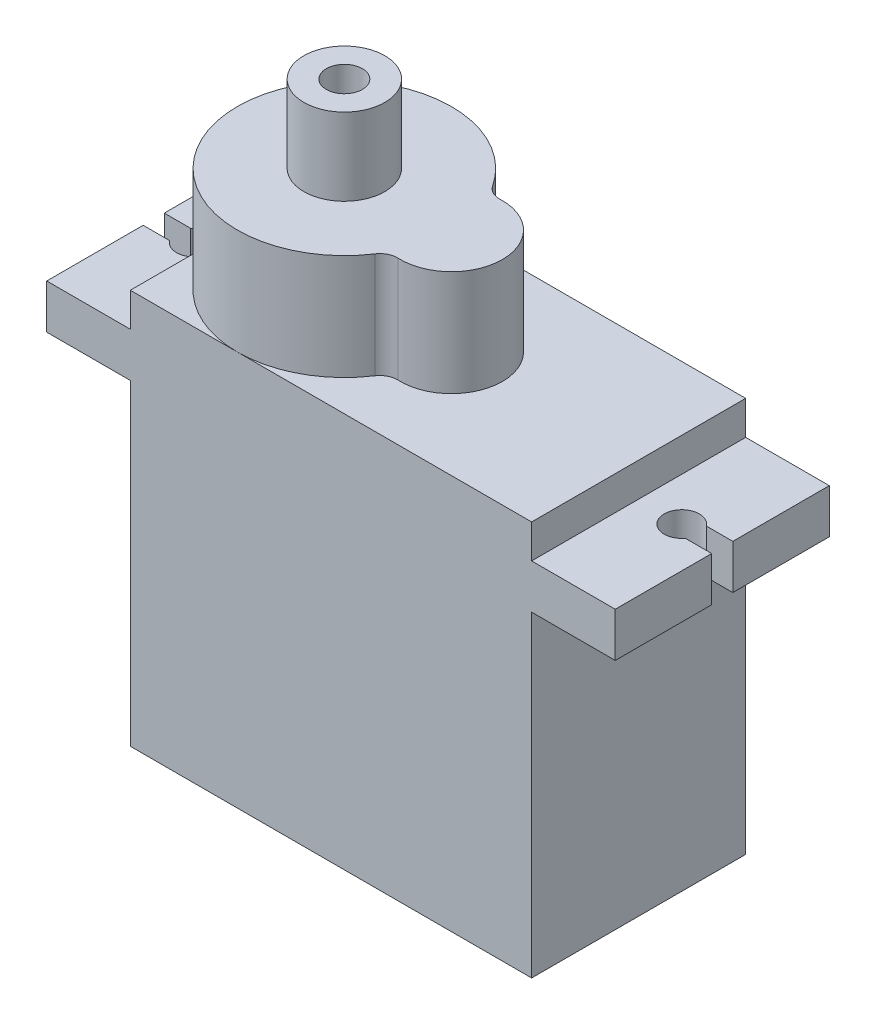
ISO-10303-21;
HEADER;
FILE_DESCRIPTION(('STEP AP214'),'2;1');
FILE_NAME('part.step','',(''),(''),'','','');
FILE_SCHEMA(('AUTOMOTIVE_DESIGN { 1 0 10303 214 1 1 1 1 }'));
ENDSEC;
DATA;
#1=APPLICATION_CONTEXT('core data for automotive mechanical design processes');
#2=APPLICATION_PROTOCOL_DEFINITION('international standard','automotive_design',2000,#1);
#3=PRODUCT_CONTEXT('',#1,'mechanical');
#4=PRODUCT('Part','Part','',(#3));
#5=PRODUCT_RELATED_PRODUCT_CATEGORY('part','',(#4));
#6=PRODUCT_DEFINITION_FORMATION('','',#4);
#7=PRODUCT_DEFINITION_CONTEXT('part definition',#1,'design');
#8=PRODUCT_DEFINITION('design','',#6,#7);
#9=PRODUCT_DEFINITION_SHAPE('','',#8);
#10=(LENGTH_UNIT() NAMED_UNIT(*) SI_UNIT(.MILLI.,.METRE.));
#11=(NAMED_UNIT(*) PLANE_ANGLE_UNIT() SI_UNIT($,.RADIAN.));
#12=(NAMED_UNIT(*) SI_UNIT($,.STERADIAN.) SOLID_ANGLE_UNIT());
#13=UNCERTAINTY_MEASURE_WITH_UNIT(LENGTH_MEASURE(1.E-05),#10,'distance_accuracy_value','');
#14=(GEOMETRIC_REPRESENTATION_CONTEXT(3) GLOBAL_UNCERTAINTY_ASSIGNED_CONTEXT((#13)) GLOBAL_UNIT_ASSIGNED_CONTEXT((#10,
#11,#12)) REPRESENTATION_CONTEXT('',''));
#15=CARTESIAN_POINT('',(0.,0.,0.));
#16=DIRECTION('',(0.,0.,1.));
#17=DIRECTION('',(1.,0.,0.));
#18=AXIS2_PLACEMENT_3D('',#15,#16,#17);
#19=CARTESIAN_POINT('',(-11.4,22.44,-6.08));
#20=DIRECTION('',(1.,0.,0.));
#21=DIRECTION('',(0.,0.,-1.));
#22=AXIS2_PLACEMENT_3D('',#19,#20,#21);
#23=PLANE('',#22);
#24=DIRECTION('',(0.,0.,1.));
#25=VECTOR('',#24,1.);
#26=CARTESIAN_POINT('',(-11.4,18.,-6.08));
#27=LINE('',#26,#25);
#28=CARTESIAN_POINT('',(-11.4,18.,-6.08));
#29=VERTEX_POINT('',#28);
#30=CARTESIAN_POINT('',(-11.4,18.,6.08));
#31=VERTEX_POINT('',#30);
#32=EDGE_CURVE('E429',#29,#31,#27,.T.);
#33=ORIENTED_EDGE('',*,*,#32,.F.);
#34=DIRECTION('',(0.,-1.,0.));
#35=VECTOR('',#34,1.);
#36=CARTESIAN_POINT('',(-11.4,22.44,-6.08));
#37=LINE('',#36,#35);
#38=CARTESIAN_POINT('',(-11.4,0.,-6.08));
#39=VERTEX_POINT('',#38);
#40=EDGE_CURVE('E487',#29,#39,#37,.T.);
#41=ORIENTED_EDGE('',*,*,#40,.T.);
#42=DIRECTION('',(0.,0.,1.));
#43=VECTOR('',#42,1.);
#44=CARTESIAN_POINT('',(-11.4,0.,-6.08));
#45=LINE('',#44,#43);
#46=CARTESIAN_POINT('',(-11.4,0.,6.08));
#47=VERTEX_POINT('',#46);
#48=EDGE_CURVE('E472',#39,#47,#45,.T.);
#49=ORIENTED_EDGE('',*,*,#48,.T.);
#50=DIRECTION('',(0.,-1.,0.));
#51=VECTOR('',#50,1.);
#52=CARTESIAN_POINT('',(-11.4,22.44,6.08));
#53=LINE('',#52,#51);
#54=EDGE_CURVE('E482',#31,#47,#53,.T.);
#55=ORIENTED_EDGE('',*,*,#54,.F.);
#56=EDGE_LOOP('',(#33,#41,#49,#55));
#57=FACE_BOUND('',#56,.T.);
#58=DIRECTION('',(0.,1.,0.));
#59=VECTOR('',#58,1.);
#60=CARTESIAN_POINT('',(-11.4,5.58,1.8));
#61=LINE('',#60,#59);
#62=CARTESIAN_POINT('',(-11.4,4.28,1.8));
#63=VERTEX_POINT('',#62);
#64=CARTESIAN_POINT('',(-11.4,5.58,1.8));
#65=VERTEX_POINT('',#64);
#66=EDGE_CURVE('E260',#63,#65,#61,.T.);
#67=ORIENTED_EDGE('',*,*,#66,.F.);
#68=DIRECTION('',(0.,0.,1.));
#69=VECTOR('',#68,1.);
#70=CARTESIAN_POINT('',(-11.4,4.28,-1.8));
#71=LINE('',#70,#69);
#72=CARTESIAN_POINT('',(-11.4,4.28,-1.8));
#73=VERTEX_POINT('',#72);
#74=EDGE_CURVE('E257',#73,#63,#71,.T.);
#75=ORIENTED_EDGE('',*,*,#74,.F.);
#76=DIRECTION('',(0.,-1.,0.));
#77=VECTOR('',#76,1.);
#78=CARTESIAN_POINT('',(-11.4,5.58,-1.8));
#79=LINE('',#78,#77);
#80=CARTESIAN_POINT('',(-11.4,5.58,-1.8));
#81=VERTEX_POINT('',#80);
#82=EDGE_CURVE('E62',#81,#73,#79,.T.);
#83=ORIENTED_EDGE('',*,*,#82,.F.);
#84=DIRECTION('',(0.,0.,-1.));
#85=VECTOR('',#84,1.);
#86=CARTESIAN_POINT('',(-11.4,5.58,-1.8));
#87=LINE('',#86,#85);
#88=EDGE_CURVE('E57',#65,#81,#87,.T.);
#89=ORIENTED_EDGE('',*,*,#88,.F.);
#90=EDGE_LOOP('',(#67,#75,#83,#89));
#91=FACE_BOUND('',#90,.T.);
#92=ADVANCED_FACE('F41',(#57,#91),#23,.F.);
#93=CARTESIAN_POINT('',(-16.15,20.52,6.08));
#94=DIRECTION('',(1.,0.,0.));
#95=DIRECTION('',(0.,0.,-1.));
#96=AXIS2_PLACEMENT_3D('',#93,#94,#95);
#97=PLANE('',#96);
#98=DIRECTION('',(0.,1.,0.));
#99=VECTOR('',#98,1.);
#100=CARTESIAN_POINT('',(-16.15,-0.001000000000001,-0.6));
#101=LINE('',#100,#99);
#102=CARTESIAN_POINT('',(-16.15,18.,-0.6));
#103=VERTEX_POINT('',#102);
#104=CARTESIAN_POINT('',(-16.15,20.52,-0.6));
#105=VERTEX_POINT('',#104);
#106=EDGE_CURVE('E288',#103,#105,#101,.T.);
#107=ORIENTED_EDGE('',*,*,#106,.T.);
#108=DIRECTION('',(0.,0.,1.));
#109=VECTOR('',#108,1.);
#110=CARTESIAN_POINT('',(-16.15,20.52,6.08));
#111=LINE('',#110,#109);
#112=CARTESIAN_POINT('',(-16.15,20.52,-6.08));
#113=VERTEX_POINT('',#112);
#114=EDGE_CURVE('E374',#113,#105,#111,.T.);
#115=ORIENTED_EDGE('',*,*,#114,.F.);
#116=DIRECTION('',(0.,-1.,0.));
#117=VECTOR('',#116,1.);
#118=CARTESIAN_POINT('',(-16.15,20.52,-6.08));
#119=LINE('',#118,#117);
#120=CARTESIAN_POINT('',(-16.15,18.,-6.08));
#121=VERTEX_POINT('',#120);
#122=EDGE_CURVE('E394',#113,#121,#119,.T.);
#123=ORIENTED_EDGE('',*,*,#122,.T.);
#124=DIRECTION('',(0.,0.,1.));
#125=VECTOR('',#124,1.);
#126=CARTESIAN_POINT('',(-16.15,18.,6.08));
#127=LINE('',#126,#125);
#128=EDGE_CURVE('E395',#121,#103,#127,.T.);
#129=ORIENTED_EDGE('',*,*,#128,.T.);
#130=EDGE_LOOP('',(#107,#115,#123,#129));
#131=FACE_BOUND('',#130,.T.);
#132=ADVANCED_FACE('F629',(#131),#97,.F.);
#133=CARTESIAN_POINT('',(0.,18.,0.));
#134=DIRECTION('',(0.,1.,0.));
#135=DIRECTION('',(0.,0.,1.));
#136=AXIS2_PLACEMENT_3D('',#133,#134,#135);
#137=PLANE('',#136);
#138=DIRECTION('',(-1.,0.,0.));
#139=VECTOR('',#138,1.);
#140=CARTESIAN_POINT('',(0.,18.,-0.6));
#141=LINE('',#140,#139);
#142=CARTESIAN_POINT('',(-14.65,18.,-0.6));
#143=VERTEX_POINT('',#142);
#144=EDGE_CURVE('E297',#143,#103,#141,.T.);
#145=ORIENTED_EDGE('',*,*,#144,.T.);
#146=ORIENTED_EDGE('',*,*,#128,.F.);
#147=DIRECTION('',(-1.,0.,0.));
#148=VECTOR('',#147,1.);
#149=CARTESIAN_POINT('',(16.15,18.,-6.08));
#150=LINE('',#149,#148);
#151=EDGE_CURVE('E409',#29,#121,#150,.T.);
#152=ORIENTED_EDGE('',*,*,#151,.F.);
#153=ORIENTED_EDGE('',*,*,#32,.T.);
#154=DIRECTION('',(1.,0.,0.));
#155=VECTOR('',#154,1.);
#156=CARTESIAN_POINT('',(16.15,18.,6.08));
#157=LINE('',#156,#155);
#158=CARTESIAN_POINT('',(-16.15,18.,6.08));
#159=VERTEX_POINT('',#158);
#160=EDGE_CURVE('E400',#159,#31,#157,.T.);
#161=ORIENTED_EDGE('',*,*,#160,.F.);
#162=CARTESIAN_POINT('',(-16.15,18.,0.6));
#163=VERTEX_POINT('',#162);
#164=EDGE_CURVE('E366',#163,#159,#127,.T.);
#165=ORIENTED_EDGE('',*,*,#164,.F.);
#166=DIRECTION('',(-1.,0.,0.));
#167=VECTOR('',#166,1.);
#168=CARTESIAN_POINT('',(0.,18.,0.6));
#169=LINE('',#168,#167);
#170=CARTESIAN_POINT('',(-14.65,18.,0.6));
#171=VERTEX_POINT('',#170);
#172=EDGE_CURVE('E317',#171,#163,#169,.T.);
#173=ORIENTED_EDGE('',*,*,#172,.F.);
#174=CARTESIAN_POINT('',(-13.85,18.,0.));
#175=DIRECTION('',(0.,1.,0.));
#176=DIRECTION('',(0.,0.,1.));
#177=AXIS2_PLACEMENT_3D('',#174,#175,#176);
#178=CIRCLE('',#177,1.);
#179=EDGE_CURVE('E293',#143,#171,#178,.F.);
#180=ORIENTED_EDGE('',*,*,#179,.F.);
#181=EDGE_LOOP('',(#145,#146,#152,#153,#161,#165,#173,#180));
#182=FACE_BOUND('',#181,.T.);
#183=ADVANCED_FACE('F608',(#182),#137,.F.);
#184=CARTESIAN_POINT('',(0.,20.52,0.));
#185=DIRECTION('',(0.,1.,0.));
#186=DIRECTION('',(0.,0.,1.));
#187=AXIS2_PLACEMENT_3D('',#184,#185,#186);
#188=PLANE('',#187);
#189=ORIENTED_EDGE('',*,*,#114,.T.);
#190=DIRECTION('',(1.,0.,0.));
#191=VECTOR('',#190,1.);
#192=CARTESIAN_POINT('',(0.,20.52,-0.6));
#193=LINE('',#192,#191);
#194=CARTESIAN_POINT('',(-14.65,20.52,-0.6));
#195=VERTEX_POINT('',#194);
#196=EDGE_CURVE('E309',#105,#195,#193,.T.);
#197=ORIENTED_EDGE('',*,*,#196,.T.);
#198=CARTESIAN_POINT('',(-13.85,20.52,0.));
#199=DIRECTION('',(0.,1.,0.));
#200=DIRECTION('',(0.,0.,1.));
#201=AXIS2_PLACEMENT_3D('',#198,#199,#200);
#202=CIRCLE('',#201,1.);
#203=CARTESIAN_POINT('',(-14.65,20.52,0.6));
#204=VERTEX_POINT('',#203);
#205=EDGE_CURVE('E305',#204,#195,#202,.T.);
#206=ORIENTED_EDGE('',*,*,#205,.F.);
#207=DIRECTION('',(1.,0.,0.));
#208=VECTOR('',#207,1.);
#209=CARTESIAN_POINT('',(0.,20.52,0.6));
#210=LINE('',#209,#208);
#211=CARTESIAN_POINT('',(-16.15,20.52,0.6));
#212=VERTEX_POINT('',#211);
#213=EDGE_CURVE('E301',#212,#204,#210,.T.);
#214=ORIENTED_EDGE('',*,*,#213,.F.);
#215=CARTESIAN_POINT('',(-16.15,20.52,6.08));
#216=VERTEX_POINT('',#215);
#217=EDGE_CURVE('E379',#212,#216,#111,.T.);
#218=ORIENTED_EDGE('',*,*,#217,.T.);
#219=DIRECTION('',(1.,0.,0.));
#220=VECTOR('',#219,1.);
#221=CARTESIAN_POINT('',(16.15,20.52,6.08));
#222=LINE('',#221,#220);
#223=CARTESIAN_POINT('',(-11.4,20.52,6.08));
#224=VERTEX_POINT('',#223);
#225=EDGE_CURVE('E380',#216,#224,#222,.T.);
#226=ORIENTED_EDGE('',*,*,#225,.T.);
#227=DIRECTION('',(0.,0.,1.));
#228=VECTOR('',#227,1.);
#229=CARTESIAN_POINT('',(-11.4,20.52,-6.08));
#230=LINE('',#229,#228);
#231=CARTESIAN_POINT('',(-11.4,20.52,-6.08));
#232=VERTEX_POINT('',#231);
#233=EDGE_CURVE('E437',#232,#224,#230,.T.);
#234=ORIENTED_EDGE('',*,*,#233,.F.);
#235=DIRECTION('',(-1.,0.,0.));
#236=VECTOR('',#235,1.);
#237=CARTESIAN_POINT('',(16.15,20.52,-6.08));
#238=LINE('',#237,#236);
#239=EDGE_CURVE('E389',#232,#113,#238,.T.);
#240=ORIENTED_EDGE('',*,*,#239,.T.);
#241=EDGE_LOOP('',(#189,#197,#206,#214,#218,#226,#234,#240));
#242=FACE_BOUND('',#241,.T.);
#243=ADVANCED_FACE('F615',(#242),#188,.T.);
#244=CARTESIAN_POINT('',(16.15,20.52,6.08));
#245=DIRECTION('',(-1.,0.,0.));
#246=DIRECTION('',(0.,0.,1.));
#247=AXIS2_PLACEMENT_3D('',#244,#245,#246);
#248=PLANE('',#247);
#249=DIRECTION('',(0.,1.,0.));
#250=VECTOR('',#249,1.);
#251=CARTESIAN_POINT('',(16.15,-0.001000000000001,0.6));
#252=LINE('',#251,#250);
#253=CARTESIAN_POINT('',(16.15,18.,0.6));
#254=VERTEX_POINT('',#253);
#255=CARTESIAN_POINT('',(16.15,20.52,0.6));
#256=VERTEX_POINT('',#255);
#257=EDGE_CURVE('E281',#254,#256,#252,.T.);
#258=ORIENTED_EDGE('',*,*,#257,.T.);
#259=DIRECTION('',(0.,0.,-1.));
#260=VECTOR('',#259,1.);
#261=CARTESIAN_POINT('',(16.15,20.52,6.08));
#262=LINE('',#261,#260);
#263=CARTESIAN_POINT('',(16.15,20.52,6.08));
#264=VERTEX_POINT('',#263);
#265=EDGE_CURVE('E385',#264,#256,#262,.T.);
#266=ORIENTED_EDGE('',*,*,#265,.F.);
#267=DIRECTION('',(0.,-1.,0.));
#268=VECTOR('',#267,1.);
#269=CARTESIAN_POINT('',(16.15,20.52,6.08));
#270=LINE('',#269,#268);
#271=CARTESIAN_POINT('',(16.15,18.,6.08));
#272=VERTEX_POINT('',#271);
#273=EDGE_CURVE('E421',#264,#272,#270,.T.);
#274=ORIENTED_EDGE('',*,*,#273,.T.);
#275=DIRECTION('',(0.,0.,-1.));
#276=VECTOR('',#275,1.);
#277=CARTESIAN_POINT('',(16.15,18.,6.08));
#278=LINE('',#277,#276);
#279=EDGE_CURVE('E405',#272,#254,#278,.T.);
#280=ORIENTED_EDGE('',*,*,#279,.T.);
#281=EDGE_LOOP('',(#258,#266,#274,#280));
#282=FACE_BOUND('',#281,.T.);
#283=ADVANCED_FACE('F670',(#282),#248,.F.);
#284=CARTESIAN_POINT('',(0.,22.44,0.));
#285=DIRECTION('',(0.,1.,0.));
#286=DIRECTION('',(0.,0.,1.));
#287=AXIS2_PLACEMENT_3D('',#284,#285,#286);
#288=PLANE('',#287);
#289=CARTESIAN_POINT('',(-5.32,22.44,0.));
#290=DIRECTION('',(0.,1.,0.));
#291=DIRECTION('',(0.,0.,1.));
#292=AXIS2_PLACEMENT_3D('',#289,#290,#291);
#293=CIRCLE('',#292,6.08);
#294=CARTESIAN_POINT('',(-0.24353107344633,22.44,-3.34602200198011));
#295=VERTEX_POINT('',#294);
#296=CARTESIAN_POINT('',(-5.32,22.44,-6.08));
#297=VERTEX_POINT('',#296);
#298=EDGE_CURVE('E322',#295,#297,#293,.T.);
#299=ORIENTED_EDGE('',*,*,#298,.F.);
#300=CARTESIAN_POINT('',(0.591414473684208,22.44,-3.89635456809527));
#301=DIRECTION('',(0.,1.,0.));
#302=DIRECTION('',(0.,0.,1.));
#303=AXIS2_PLACEMENT_3D('',#300,#301,#302);
#304=CIRCLE('',#303,1.);
#305=CARTESIAN_POINT('',(0.634641531713898,22.44,-2.89728929422468));
#306=VERTEX_POINT('',#305);
#307=EDGE_CURVE('E506',#295,#306,#304,.T.);
#308=ORIENTED_EDGE('',*,*,#307,.T.);
#309=CARTESIAN_POINT('',(0.759999999999999,22.44,0.));
#310=DIRECTION('',(0.,1.,0.));
#311=DIRECTION('',(0.,0.,1.));
#312=AXIS2_PLACEMENT_3D('',#309,#310,#311);
#313=CIRCLE('',#312,2.9);
#314=CARTESIAN_POINT('',(0.634641531713898,22.44,2.89728929422468));
#315=VERTEX_POINT('',#314);
#316=EDGE_CURVE('E362',#315,#306,#313,.T.);
#317=ORIENTED_EDGE('',*,*,#316,.F.);
#318=CARTESIAN_POINT('',(0.591414473684209,22.44,3.89635456809526));
#319=DIRECTION('',(0.,1.,0.));
#320=DIRECTION('',(0.,0.,1.));
#321=AXIS2_PLACEMENT_3D('',#318,#319,#320);
#322=CIRCLE('',#321,1.);
#323=CARTESIAN_POINT('',(-0.24353107344633,22.44,3.34602200198011));
#324=VERTEX_POINT('',#323);
#325=EDGE_CURVE('E503',#315,#324,#322,.T.);
#326=ORIENTED_EDGE('',*,*,#325,.T.);
#327=CARTESIAN_POINT('',(-5.32,22.44,6.08));
#328=VERTEX_POINT('',#327);
#329=EDGE_CURVE('E370',#328,#324,#293,.T.);
#330=ORIENTED_EDGE('',*,*,#329,.F.);
#331=DIRECTION('',(1.,0.,0.));
#332=VECTOR('',#331,1.);
#333=CARTESIAN_POINT('',(-11.4,22.44,6.08));
#334=LINE('',#333,#332);
#335=CARTESIAN_POINT('',(11.4,22.44,6.08));
#336=VERTEX_POINT('',#335);
#337=EDGE_CURVE('E459',#328,#336,#334,.T.);
#338=ORIENTED_EDGE('',*,*,#337,.T.);
#339=DIRECTION('',(0.,0.,-1.));
#340=VECTOR('',#339,1.);
#341=CARTESIAN_POINT('',(11.4,22.44,-6.08));
#342=LINE('',#341,#340);
#343=CARTESIAN_POINT('',(11.4,22.44,-6.08));
#344=VERTEX_POINT('',#343);
#345=EDGE_CURVE('E444',#336,#344,#342,.T.);
#346=ORIENTED_EDGE('',*,*,#345,.T.);
#347=DIRECTION('',(-1.,0.,0.));
#348=VECTOR('',#347,1.);
#349=CARTESIAN_POINT('',(-11.4,22.44,-6.08));
#350=LINE('',#349,#348);
#351=EDGE_CURVE('E450',#344,#297,#350,.T.);
#352=ORIENTED_EDGE('',*,*,#351,.T.);
#353=EDGE_LOOP('',(#299,#308,#317,#326,#330,#338,#346,#352));
#354=FACE_BOUND('',#353,.T.);
#355=ADVANCED_FACE('F533',(#354),#288,.T.);
#356=CARTESIAN_POINT('',(-11.4,22.44,0.));
#357=VERTEX_POINT('',#356);
#358=EDGE_CURVE('E369',#297,#357,#293,.T.);
#359=ORIENTED_EDGE('',*,*,#358,.F.);
#360=CARTESIAN_POINT('',(-11.4,22.44,-6.08));
#361=VERTEX_POINT('',#360);
#362=EDGE_CURVE('E448',#297,#361,#350,.T.);
#363=ORIENTED_EDGE('',*,*,#362,.T.);
#364=DIRECTION('',(0.,0.,1.));
#365=VECTOR('',#364,1.);
#366=CARTESIAN_POINT('',(-11.4,22.44,-6.08));
#367=LINE('',#366,#365);
#368=EDGE_CURVE('E455',#361,#357,#367,.T.);
#369=ORIENTED_EDGE('',*,*,#368,.T.);
#370=EDGE_LOOP('',(#359,#363,#369));
#371=FACE_BOUND('',#370,.T.);
#372=ADVANCED_FACE('F548',(#371),#288,.T.);
#373=CARTESIAN_POINT('',(11.4,22.44,-6.08));
#374=DIRECTION('',(-1.,0.,0.));
#375=DIRECTION('',(0.,0.,1.));
#376=AXIS2_PLACEMENT_3D('',#373,#374,#375);
#377=PLANE('',#376);
#378=DIRECTION('',(0.,0.,-1.));
#379=VECTOR('',#378,1.);
#380=CARTESIAN_POINT('',(11.4,18.,-6.08));
#381=LINE('',#380,#379);
#382=CARTESIAN_POINT('',(11.4,18.,6.08));
#383=VERTEX_POINT('',#382);
#384=CARTESIAN_POINT('',(11.4,18.,-6.08));
#385=VERTEX_POINT('',#384);
#386=EDGE_CURVE('E433',#383,#385,#381,.T.);
#387=ORIENTED_EDGE('',*,*,#386,.F.);
#388=DIRECTION('',(0.,-1.,0.));
#389=VECTOR('',#388,1.);
#390=CARTESIAN_POINT('',(11.4,22.44,6.08));
#391=LINE('',#390,#389);
#392=CARTESIAN_POINT('',(11.4,0.,6.08));
#393=VERTEX_POINT('',#392);
#394=EDGE_CURVE('E464',#383,#393,#391,.T.);
#395=ORIENTED_EDGE('',*,*,#394,.T.);
#396=DIRECTION('',(0.,0.,-1.));
#397=VECTOR('',#396,1.);
#398=CARTESIAN_POINT('',(11.4,0.,-6.08));
#399=LINE('',#398,#397);
#400=CARTESIAN_POINT('',(11.4,0.,-6.08));
#401=VERTEX_POINT('',#400);
#402=EDGE_CURVE('E443',#393,#401,#399,.T.);
#403=ORIENTED_EDGE('',*,*,#402,.T.);
#404=DIRECTION('',(0.,-1.,0.));
#405=VECTOR('',#404,1.);
#406=CARTESIAN_POINT('',(11.4,22.44,-6.08));
#407=LINE('',#406,#405);
#408=EDGE_CURVE('E491',#385,#401,#407,.T.);
#409=ORIENTED_EDGE('',*,*,#408,.F.);
#410=EDGE_LOOP('',(#387,#395,#403,#409));
#411=FACE_BOUND('',#410,.T.);
#412=ADVANCED_FACE('F582',(#411),#377,.F.);
#413=CARTESIAN_POINT('',(11.4,20.52,6.08));
#414=VERTEX_POINT('',#413);
#415=EDGE_CURVE('E479',#336,#414,#391,.T.);
#416=ORIENTED_EDGE('',*,*,#415,.T.);
#417=DIRECTION('',(0.,0.,-1.));
#418=VECTOR('',#417,1.);
#419=CARTESIAN_POINT('',(11.4,20.52,-6.08));
#420=LINE('',#419,#418);
#421=CARTESIAN_POINT('',(11.4,20.52,-6.08));
#422=VERTEX_POINT('',#421);
#423=EDGE_CURVE('E440',#414,#422,#420,.T.);
#424=ORIENTED_EDGE('',*,*,#423,.T.);
#425=EDGE_CURVE('E492',#344,#422,#407,.T.);
#426=ORIENTED_EDGE('',*,*,#425,.F.);
#427=ORIENTED_EDGE('',*,*,#345,.F.);
#428=EDGE_LOOP('',(#416,#424,#426,#427));
#429=FACE_BOUND('',#428,.T.);
#430=ADVANCED_FACE('F559',(#429),#377,.F.);
#431=CARTESIAN_POINT('',(-11.4,22.44,-6.08));
#432=DIRECTION('',(0.,0.,1.));
#433=DIRECTION('',(1.,0.,0.));
#434=AXIS2_PLACEMENT_3D('',#431,#432,#433);
#435=PLANE('',#434);
#436=ORIENTED_EDGE('',*,*,#425,.T.);
#437=CARTESIAN_POINT('',(16.15,20.52,-6.08));
#438=VERTEX_POINT('',#437);
#439=EDGE_CURVE('E390',#438,#422,#238,.T.);
#440=ORIENTED_EDGE('',*,*,#439,.F.);
#441=DIRECTION('',(0.,-1.,0.));
#442=VECTOR('',#441,1.);
#443=CARTESIAN_POINT('',(16.15,20.52,-6.08));
#444=LINE('',#443,#442);
#445=CARTESIAN_POINT('',(16.15,18.,-6.08));
#446=VERTEX_POINT('',#445);
#447=EDGE_CURVE('E417',#438,#446,#444,.T.);
#448=ORIENTED_EDGE('',*,*,#447,.T.);
#449=EDGE_CURVE('E410',#446,#385,#150,.T.);
#450=ORIENTED_EDGE('',*,*,#449,.T.);
#451=ORIENTED_EDGE('',*,*,#408,.T.);
#452=DIRECTION('',(-1.,0.,0.));
#453=VECTOR('',#452,1.);
#454=CARTESIAN_POINT('',(-11.4,0.,-6.08));
#455=LINE('',#454,#453);
#456=EDGE_CURVE('E468',#401,#39,#455,.T.);
#457=ORIENTED_EDGE('',*,*,#456,.T.);
#458=ORIENTED_EDGE('',*,*,#40,.F.);
#459=ORIENTED_EDGE('',*,*,#151,.T.);
#460=ORIENTED_EDGE('',*,*,#122,.F.);
#461=ORIENTED_EDGE('',*,*,#239,.F.);
#462=EDGE_CURVE('E488',#361,#232,#37,.T.);
#463=ORIENTED_EDGE('',*,*,#462,.F.);
#464=ORIENTED_EDGE('',*,*,#362,.F.);
#465=ORIENTED_EDGE('',*,*,#351,.F.);
#466=EDGE_LOOP('',(#436,#440,#448,#450,#451,#457,#458,#459,#460,#461,#463,#464,#465));
#467=FACE_BOUND('',#466,.T.);
#468=ADVANCED_FACE('F552',(#467),#435,.F.);
#469=ORIENTED_EDGE('',*,*,#462,.T.);
#470=ORIENTED_EDGE('',*,*,#233,.T.);
#471=CARTESIAN_POINT('',(-11.4,22.44,6.08));
#472=VERTEX_POINT('',#471);
#473=EDGE_CURVE('E483',#472,#224,#53,.T.);
#474=ORIENTED_EDGE('',*,*,#473,.F.);
#475=EDGE_CURVE('E454',#357,#472,#367,.T.);
#476=ORIENTED_EDGE('',*,*,#475,.F.);
#477=ORIENTED_EDGE('',*,*,#368,.F.);
#478=EDGE_LOOP('',(#469,#470,#474,#476,#477));
#479=FACE_BOUND('',#478,.T.);
#480=ADVANCED_FACE('F654',(#479),#23,.F.);
#481=CARTESIAN_POINT('',(-11.4,22.44,6.08));
#482=DIRECTION('',(0.,0.,-1.));
#483=DIRECTION('',(-1.,0.,0.));
#484=AXIS2_PLACEMENT_3D('',#481,#482,#483);
#485=PLANE('',#484);
#486=ORIENTED_EDGE('',*,*,#473,.T.);
#487=ORIENTED_EDGE('',*,*,#225,.F.);
#488=DIRECTION('',(0.,-1.,0.));
#489=VECTOR('',#488,1.);
#490=CARTESIAN_POINT('',(-16.15,20.52,6.08));
#491=LINE('',#490,#489);
#492=EDGE_CURVE('E425',#216,#159,#491,.T.);
#493=ORIENTED_EDGE('',*,*,#492,.T.);
#494=ORIENTED_EDGE('',*,*,#160,.T.);
#495=ORIENTED_EDGE('',*,*,#54,.T.);
#496=DIRECTION('',(1.,0.,0.));
#497=VECTOR('',#496,1.);
#498=CARTESIAN_POINT('',(-11.4,0.,6.08));
#499=LINE('',#498,#497);
#500=EDGE_CURVE('E449',#47,#393,#499,.T.);
#501=ORIENTED_EDGE('',*,*,#500,.T.);
#502=ORIENTED_EDGE('',*,*,#394,.F.);
#503=EDGE_CURVE('E399',#383,#272,#157,.T.);
#504=ORIENTED_EDGE('',*,*,#503,.T.);
#505=ORIENTED_EDGE('',*,*,#273,.F.);
#506=EDGE_CURVE('E378',#414,#264,#222,.T.);
#507=ORIENTED_EDGE('',*,*,#506,.F.);
#508=ORIENTED_EDGE('',*,*,#415,.F.);
#509=ORIENTED_EDGE('',*,*,#337,.F.);
#510=EDGE_CURVE('E460',#472,#328,#334,.T.);
#511=ORIENTED_EDGE('',*,*,#510,.F.);
#512=EDGE_LOOP('',(#486,#487,#493,#494,#495,#501,#502,#504,#505,#507,#508,#509,#511));
#513=FACE_BOUND('',#512,.T.);
#514=ADVANCED_FACE('F584',(#513),#485,.F.);
#515=EDGE_CURVE('E541',#357,#328,#293,.T.);
#516=ORIENTED_EDGE('',*,*,#515,.F.);
#517=ORIENTED_EDGE('',*,*,#475,.T.);
#518=ORIENTED_EDGE('',*,*,#510,.T.);
#519=EDGE_LOOP('',(#516,#517,#518));
#520=FACE_BOUND('',#519,.T.);
#521=ADVANCED_FACE('F640',(#520),#288,.T.);
#522=CARTESIAN_POINT('',(0.,0.,0.));
#523=DIRECTION('',(0.,1.,0.));
#524=DIRECTION('',(0.,0.,1.));
#525=AXIS2_PLACEMENT_3D('',#522,#523,#524);
#526=PLANE('',#525);
#527=ORIENTED_EDGE('',*,*,#402,.F.);
#528=ORIENTED_EDGE('',*,*,#500,.F.);
#529=ORIENTED_EDGE('',*,*,#48,.F.);
#530=ORIENTED_EDGE('',*,*,#456,.F.);
#531=EDGE_LOOP('',(#527,#528,#529,#530));
#532=FACE_BOUND('',#531,.T.);
#533=ADVANCED_FACE('F638',(#532),#526,.F.);
#534=ORIENTED_EDGE('',*,*,#217,.F.);
#535=DIRECTION('',(0.,1.,0.));
#536=VECTOR('',#535,1.);
#537=CARTESIAN_POINT('',(-16.15,-0.001000000000001,0.6));
#538=LINE('',#537,#536);
#539=EDGE_CURVE('E285',#163,#212,#538,.T.);
#540=ORIENTED_EDGE('',*,*,#539,.F.);
#541=ORIENTED_EDGE('',*,*,#164,.T.);
#542=ORIENTED_EDGE('',*,*,#492,.F.);
#543=EDGE_LOOP('',(#534,#540,#541,#542));
#544=FACE_BOUND('',#543,.T.);
#545=ADVANCED_FACE('F605',(#544),#97,.F.);
#546=DIRECTION('',(-1.,0.,0.));
#547=VECTOR('',#546,1.);
#548=CARTESIAN_POINT('',(0.,20.52,-0.6));
#549=LINE('',#548,#547);
#550=CARTESIAN_POINT('',(16.15,20.52,-0.6));
#551=VERTEX_POINT('',#550);
#552=CARTESIAN_POINT('',(14.65,20.52,-0.6));
#553=VERTEX_POINT('',#552);
#554=EDGE_CURVE('E344',#551,#553,#549,.T.);
#555=ORIENTED_EDGE('',*,*,#554,.F.);
#556=EDGE_CURVE('E384',#551,#438,#262,.T.);
#557=ORIENTED_EDGE('',*,*,#556,.T.);
#558=ORIENTED_EDGE('',*,*,#439,.T.);
#559=ORIENTED_EDGE('',*,*,#423,.F.);
#560=ORIENTED_EDGE('',*,*,#506,.T.);
#561=ORIENTED_EDGE('',*,*,#265,.T.);
#562=DIRECTION('',(-1.,0.,0.));
#563=VECTOR('',#562,1.);
#564=CARTESIAN_POINT('',(0.,20.52,0.6));
#565=LINE('',#564,#563);
#566=CARTESIAN_POINT('',(14.65,20.52,0.6));
#567=VERTEX_POINT('',#566);
#568=EDGE_CURVE('E340',#256,#567,#565,.T.);
#569=ORIENTED_EDGE('',*,*,#568,.T.);
#570=CARTESIAN_POINT('',(13.85,20.52,0.));
#571=DIRECTION('',(0.,1.,0.));
#572=DIRECTION('',(0.,0.,1.));
#573=AXIS2_PLACEMENT_3D('',#570,#571,#572);
#574=CIRCLE('',#573,1.);
#575=EDGE_CURVE('E336',#553,#567,#574,.T.);
#576=ORIENTED_EDGE('',*,*,#575,.F.);
#577=EDGE_LOOP('',(#555,#557,#558,#559,#560,#561,#569,#576));
#578=FACE_BOUND('',#577,.T.);
#579=ADVANCED_FACE('F564',(#578),#188,.T.);
#580=CARTESIAN_POINT('',(16.15,18.,-0.6));
#581=VERTEX_POINT('',#580);
#582=EDGE_CURVE('E404',#581,#446,#278,.T.);
#583=ORIENTED_EDGE('',*,*,#582,.F.);
#584=DIRECTION('',(1.,0.,0.));
#585=VECTOR('',#584,1.);
#586=CARTESIAN_POINT('',(0.,18.,-0.6));
#587=LINE('',#586,#585);
#588=CARTESIAN_POINT('',(14.65,18.,-0.6));
#589=VERTEX_POINT('',#588);
#590=EDGE_CURVE('E333',#589,#581,#587,.T.);
#591=ORIENTED_EDGE('',*,*,#590,.F.);
#592=CARTESIAN_POINT('',(13.85,18.,0.));
#593=DIRECTION('',(0.,1.,0.));
#594=DIRECTION('',(0.,0.,1.));
#595=AXIS2_PLACEMENT_3D('',#592,#593,#594);
#596=CIRCLE('',#595,1.);
#597=CARTESIAN_POINT('',(14.65,18.,0.6));
#598=VERTEX_POINT('',#597);
#599=EDGE_CURVE('E329',#598,#589,#596,.F.);
#600=ORIENTED_EDGE('',*,*,#599,.F.);
#601=DIRECTION('',(1.,0.,0.));
#602=VECTOR('',#601,1.);
#603=CARTESIAN_POINT('',(0.,18.,0.6));
#604=LINE('',#603,#602);
#605=EDGE_CURVE('E289',#598,#254,#604,.T.);
#606=ORIENTED_EDGE('',*,*,#605,.T.);
#607=ORIENTED_EDGE('',*,*,#279,.F.);
#608=ORIENTED_EDGE('',*,*,#503,.F.);
#609=ORIENTED_EDGE('',*,*,#386,.T.);
#610=ORIENTED_EDGE('',*,*,#449,.F.);
#611=EDGE_LOOP('',(#583,#591,#600,#606,#607,#608,#609,#610));
#612=FACE_BOUND('',#611,.T.);
#613=ADVANCED_FACE('F576',(#612),#137,.F.);
#614=ORIENTED_EDGE('',*,*,#556,.F.);
#615=DIRECTION('',(0.,1.,0.));
#616=VECTOR('',#615,1.);
#617=CARTESIAN_POINT('',(16.15,-0.001000000000001,-0.6));
#618=LINE('',#617,#616);
#619=EDGE_CURVE('E326',#581,#551,#618,.T.);
#620=ORIENTED_EDGE('',*,*,#619,.F.);
#621=ORIENTED_EDGE('',*,*,#582,.T.);
#622=ORIENTED_EDGE('',*,*,#447,.F.);
#623=EDGE_LOOP('',(#614,#620,#621,#622));
#624=FACE_BOUND('',#623,.T.);
#625=ADVANCED_FACE('F572',(#624),#248,.F.);
#626=CARTESIAN_POINT('',(-5.32,28.44,0.));
#627=DIRECTION('',(0.,-1.,0.));
#628=DIRECTION('',(0.,0.,-1.));
#629=AXIS2_PLACEMENT_3D('',#626,#627,#628);
#630=CYLINDRICAL_SURFACE('',#629,6.08);
#631=CARTESIAN_POINT('',(-5.32,28.44,0.));
#632=DIRECTION('',(0.,1.,0.));
#633=DIRECTION('',(0.,0.,1.));
#634=AXIS2_PLACEMENT_3D('',#631,#632,#633);
#635=CIRCLE('',#634,6.08);
#636=CARTESIAN_POINT('',(-0.24353107344633,28.44,-3.34602200198011));
#637=VERTEX_POINT('',#636);
#638=CARTESIAN_POINT('',(-0.24353107344633,28.44,3.34602200198011));
#639=VERTEX_POINT('',#638);
#640=EDGE_CURVE('E357',#637,#639,#635,.T.);
#641=ORIENTED_EDGE('',*,*,#640,.F.);
#642=DIRECTION('',(0.,-1.,0.));
#643=VECTOR('',#642,1.);
#644=CARTESIAN_POINT('',(-0.24353107344633,28.44,-3.34602200198011));
#645=LINE('',#644,#643);
#646=EDGE_CURVE('E499',#637,#295,#645,.T.);
#647=ORIENTED_EDGE('',*,*,#646,.T.);
#648=ORIENTED_EDGE('',*,*,#298,.T.);
#649=ORIENTED_EDGE('',*,*,#358,.T.);
#650=ORIENTED_EDGE('',*,*,#515,.T.);
#651=ORIENTED_EDGE('',*,*,#329,.T.);
#652=DIRECTION('',(0.,-1.,0.));
#653=VECTOR('',#652,1.);
#654=CARTESIAN_POINT('',(-0.24353107344633,28.44,3.34602200198011));
#655=LINE('',#654,#653);
#656=EDGE_CURVE('E496',#324,#639,#655,.F.);
#657=ORIENTED_EDGE('',*,*,#656,.T.);
#658=EDGE_LOOP('',(#641,#647,#648,#649,#650,#651,#657));
#659=FACE_BOUND('',#658,.T.);
#660=ADVANCED_FACE('F526',(#659),#630,.T.);
#661=CARTESIAN_POINT('',(0.759999999999999,28.44,0.));
#662=DIRECTION('',(0.,-1.,0.));
#663=DIRECTION('',(0.,0.,-1.));
#664=AXIS2_PLACEMENT_3D('',#661,#662,#663);
#665=CYLINDRICAL_SURFACE('',#664,2.9);
#666=ORIENTED_EDGE('',*,*,#316,.T.);
#667=DIRECTION('',(0.,-1.,0.));
#668=VECTOR('',#667,1.);
#669=CARTESIAN_POINT('',(0.634641531713898,28.44,-2.89728929422468));
#670=LINE('',#669,#668);
#671=CARTESIAN_POINT('',(0.634641531713898,28.44,-2.89728929422468));
#672=VERTEX_POINT('',#671);
#673=EDGE_CURVE('E513',#306,#672,#670,.F.);
#674=ORIENTED_EDGE('',*,*,#673,.T.);
#675=CARTESIAN_POINT('',(0.759999999999999,28.44,0.));
#676=DIRECTION('',(0.,1.,0.));
#677=DIRECTION('',(0.,0.,1.));
#678=AXIS2_PLACEMENT_3D('',#675,#676,#677);
#679=CIRCLE('',#678,2.9);
#680=CARTESIAN_POINT('',(0.634641531713898,28.44,2.89728929422468));
#681=VERTEX_POINT('',#680);
#682=EDGE_CURVE('E361',#681,#672,#679,.T.);
#683=ORIENTED_EDGE('',*,*,#682,.F.);
#684=DIRECTION('',(0.,-1.,0.));
#685=VECTOR('',#684,1.);
#686=CARTESIAN_POINT('',(0.634641531713898,28.44,2.89728929422468));
#687=LINE('',#686,#685);
#688=EDGE_CURVE('E509',#681,#315,#687,.T.);
#689=ORIENTED_EDGE('',*,*,#688,.T.);
#690=EDGE_LOOP('',(#666,#674,#683,#689));
#691=FACE_BOUND('',#690,.T.);
#692=ADVANCED_FACE('F535',(#691),#665,.T.);
#693=CARTESIAN_POINT('',(0.,28.44,0.));
#694=DIRECTION('',(0.,1.,0.));
#695=DIRECTION('',(0.,0.,1.));
#696=AXIS2_PLACEMENT_3D('',#693,#694,#695);
#697=PLANE('',#696);
#698=CARTESIAN_POINT('',(-5.32,28.44,0.));
#699=DIRECTION('',(0.,1.,0.));
#700=DIRECTION('',(0.,0.,1.));
#701=AXIS2_PLACEMENT_3D('',#698,#699,#700);
#702=CIRCLE('',#701,2.3);
#703=CARTESIAN_POINT('',(-5.32,28.44,2.3));
#704=VERTEX_POINT('',#703);
#705=EDGE_CURVE('E276',#704,#704,#702,.T.);
#706=ORIENTED_EDGE('',*,*,#705,.F.);
#707=EDGE_LOOP('',(#706));
#708=FACE_BOUND('',#707,.T.);
#709=ORIENTED_EDGE('',*,*,#682,.T.);
#710=CARTESIAN_POINT('',(0.591414473684208,28.44,-3.89635456809527));
#711=DIRECTION('',(0.,1.,0.));
#712=DIRECTION('',(0.,0.,1.));
#713=AXIS2_PLACEMENT_3D('',#710,#711,#712);
#714=CIRCLE('',#713,1.);
#715=EDGE_CURVE('E50',#672,#637,#714,.F.);
#716=ORIENTED_EDGE('',*,*,#715,.T.);
#717=ORIENTED_EDGE('',*,*,#640,.T.);
#718=CARTESIAN_POINT('',(0.591414473684209,28.44,3.89635456809526));
#719=DIRECTION('',(0.,1.,0.));
#720=DIRECTION('',(0.,0.,1.));
#721=AXIS2_PLACEMENT_3D('',#718,#719,#720);
#722=CIRCLE('',#721,1.);
#723=EDGE_CURVE('E11',#639,#681,#722,.F.);
#724=ORIENTED_EDGE('',*,*,#723,.T.);
#725=EDGE_LOOP('',(#709,#716,#717,#724));
#726=FACE_BOUND('',#725,.T.);
#727=ADVANCED_FACE('F519',(#708,#726),#697,.T.);
#728=CARTESIAN_POINT('',(0.591414473684208,28.44,-3.89635456809527));
#729=DIRECTION('',(0.,1.,0.));
#730=DIRECTION('',(0.,0.,1.));
#731=AXIS2_PLACEMENT_3D('',#728,#729,#730);
#732=CYLINDRICAL_SURFACE('',#731,1.);
#733=ORIENTED_EDGE('',*,*,#715,.F.);
#734=ORIENTED_EDGE('',*,*,#673,.F.);
#735=ORIENTED_EDGE('',*,*,#307,.F.);
#736=ORIENTED_EDGE('',*,*,#646,.F.);
#737=EDGE_LOOP('',(#733,#734,#735,#736));
#738=FACE_BOUND('',#737,.T.);
#739=ADVANCED_FACE('F530',(#738),#732,.F.);
#740=CARTESIAN_POINT('',(0.591414473684209,28.44,3.89635456809526));
#741=DIRECTION('',(0.,1.,0.));
#742=DIRECTION('',(0.,0.,1.));
#743=AXIS2_PLACEMENT_3D('',#740,#741,#742);
#744=CYLINDRICAL_SURFACE('',#743,1.);
#745=ORIENTED_EDGE('',*,*,#723,.F.);
#746=ORIENTED_EDGE('',*,*,#656,.F.);
#747=ORIENTED_EDGE('',*,*,#325,.F.);
#748=ORIENTED_EDGE('',*,*,#688,.F.);
#749=EDGE_LOOP('',(#745,#746,#747,#748));
#750=FACE_BOUND('',#749,.T.);
#751=ADVANCED_FACE('F43',(#750),#744,.F.);
#752=CARTESIAN_POINT('',(13.85,-0.001000000000001,0.));
#753=DIRECTION('',(0.,1.,0.));
#754=DIRECTION('',(0.,0.,1.));
#755=AXIS2_PLACEMENT_3D('',#752,#753,#754);
#756=CYLINDRICAL_SURFACE('',#755,1.);
#757=ORIENTED_EDGE('',*,*,#599,.T.);
#758=DIRECTION('',(0.,1.,0.));
#759=VECTOR('',#758,1.);
#760=CARTESIAN_POINT('',(14.65,-0.001000000000001,-0.6));
#761=LINE('',#760,#759);
#762=EDGE_CURVE('E349',#589,#553,#761,.T.);
#763=ORIENTED_EDGE('',*,*,#762,.T.);
#764=ORIENTED_EDGE('',*,*,#575,.T.);
#765=DIRECTION('',(0.,1.,0.));
#766=VECTOR('',#765,1.);
#767=CARTESIAN_POINT('',(14.65,-0.001000000000001,0.6));
#768=LINE('',#767,#766);
#769=EDGE_CURVE('E348',#598,#567,#768,.T.);
#770=ORIENTED_EDGE('',*,*,#769,.F.);
#771=EDGE_LOOP('',(#757,#763,#764,#770));
#772=FACE_BOUND('',#771,.T.);
#773=ADVANCED_FACE('F676',(#772),#756,.F.);
#774=CARTESIAN_POINT('',(0.,-0.001000000000001,-0.6));
#775=DIRECTION('',(0.,0.,-1.));
#776=DIRECTION('',(-1.,0.,0.));
#777=AXIS2_PLACEMENT_3D('',#774,#775,#776);
#778=PLANE('',#777);
#779=ORIENTED_EDGE('',*,*,#590,.T.);
#780=ORIENTED_EDGE('',*,*,#619,.T.);
#781=ORIENTED_EDGE('',*,*,#554,.T.);
#782=ORIENTED_EDGE('',*,*,#762,.F.);
#783=EDGE_LOOP('',(#779,#780,#781,#782));
#784=FACE_BOUND('',#783,.T.);
#785=ADVANCED_FACE('F678',(#784),#778,.F.);
#786=CARTESIAN_POINT('',(0.,-0.001000000000001,0.6));
#787=DIRECTION('',(0.,0.,-1.));
#788=DIRECTION('',(-1.,0.,0.));
#789=AXIS2_PLACEMENT_3D('',#786,#787,#788);
#790=PLANE('',#789);
#791=ORIENTED_EDGE('',*,*,#769,.T.);
#792=ORIENTED_EDGE('',*,*,#568,.F.);
#793=ORIENTED_EDGE('',*,*,#257,.F.);
#794=ORIENTED_EDGE('',*,*,#605,.F.);
#795=EDGE_LOOP('',(#791,#792,#793,#794));
#796=FACE_BOUND('',#795,.T.);
#797=ADVANCED_FACE('F673',(#796),#790,.T.);
#798=CARTESIAN_POINT('',(0.,-0.001000000000001,-0.6));
#799=DIRECTION('',(0.,0.,1.));
#800=DIRECTION('',(1.,0.,0.));
#801=AXIS2_PLACEMENT_3D('',#798,#799,#800);
#802=PLANE('',#801);
#803=ORIENTED_EDGE('',*,*,#144,.F.);
#804=DIRECTION('',(0.,1.,0.));
#805=VECTOR('',#804,1.);
#806=CARTESIAN_POINT('',(-14.65,-0.001000000000001,-0.6));
#807=LINE('',#806,#805);
#808=EDGE_CURVE('E314',#143,#195,#807,.T.);
#809=ORIENTED_EDGE('',*,*,#808,.T.);
#810=ORIENTED_EDGE('',*,*,#196,.F.);
#811=ORIENTED_EDGE('',*,*,#106,.F.);
#812=EDGE_LOOP('',(#803,#809,#810,#811));
#813=FACE_BOUND('',#812,.T.);
#814=ADVANCED_FACE('F626',(#813),#802,.T.);
#815=CARTESIAN_POINT('',(-13.85,-0.001000000000001,0.));
#816=DIRECTION('',(0.,1.,0.));
#817=DIRECTION('',(0.,0.,1.));
#818=AXIS2_PLACEMENT_3D('',#815,#816,#817);
#819=CYLINDRICAL_SURFACE('',#818,1.);
#820=ORIENTED_EDGE('',*,*,#179,.T.);
#821=DIRECTION('',(0.,1.,0.));
#822=VECTOR('',#821,1.);
#823=CARTESIAN_POINT('',(-14.65,-0.001000000000001,0.6));
#824=LINE('',#823,#822);
#825=EDGE_CURVE('E313',#171,#204,#824,.T.);
#826=ORIENTED_EDGE('',*,*,#825,.T.);
#827=ORIENTED_EDGE('',*,*,#205,.T.);
#828=ORIENTED_EDGE('',*,*,#808,.F.);
#829=EDGE_LOOP('',(#820,#826,#827,#828));
#830=FACE_BOUND('',#829,.T.);
#831=ADVANCED_FACE('F624',(#830),#819,.F.);
#832=CARTESIAN_POINT('',(0.,-0.001000000000001,0.6));
#833=DIRECTION('',(0.,0.,1.));
#834=DIRECTION('',(1.,0.,0.));
#835=AXIS2_PLACEMENT_3D('',#832,#833,#834);
#836=PLANE('',#835);
#837=ORIENTED_EDGE('',*,*,#539,.T.);
#838=ORIENTED_EDGE('',*,*,#213,.T.);
#839=ORIENTED_EDGE('',*,*,#825,.F.);
#840=ORIENTED_EDGE('',*,*,#172,.T.);
#841=EDGE_LOOP('',(#837,#838,#839,#840));
#842=FACE_BOUND('',#841,.T.);
#843=ADVANCED_FACE('F619',(#842),#836,.F.);
#844=CARTESIAN_POINT('',(-5.32,32.83,0.));
#845=DIRECTION('',(0.,-1.,0.));
#846=DIRECTION('',(0.,0.,-1.));
#847=AXIS2_PLACEMENT_3D('',#844,#845,#846);
#848=CYLINDRICAL_SURFACE('',#847,2.3);
#849=CARTESIAN_POINT('',(-5.32,32.83,0.));
#850=DIRECTION('',(0.,1.,0.));
#851=DIRECTION('',(0.,0.,1.));
#852=AXIS2_PLACEMENT_3D('',#849,#850,#851);
#853=CIRCLE('',#852,2.3);
#854=CARTESIAN_POINT('',(-5.32,32.83,2.3));
#855=VERTEX_POINT('',#854);
#856=EDGE_CURVE('E277',#855,#855,#853,.T.);
#857=ORIENTED_EDGE('',*,*,#856,.F.);
#858=EDGE_LOOP('',(#857));
#859=FACE_BOUND('',#858,.T.);
#860=ORIENTED_EDGE('',*,*,#705,.T.);
#861=EDGE_LOOP('',(#860));
#862=FACE_BOUND('',#861,.T.);
#863=ADVANCED_FACE('F909',(#859,#862),#848,.T.);
#864=CARTESIAN_POINT('',(-5.32,32.83,0.));
#865=DIRECTION('',(0.,1.,0.));
#866=DIRECTION('',(0.,0.,1.));
#867=AXIS2_PLACEMENT_3D('',#864,#865,#866);
#868=PLANE('',#867);
#869=CARTESIAN_POINT('',(-5.32,32.83,0.));
#870=DIRECTION('',(0.,1.,0.));
#871=DIRECTION('',(0.,0.,1.));
#872=AXIS2_PLACEMENT_3D('',#869,#870,#871);
#873=CIRCLE('',#872,1.02499999999999);
#874=CARTESIAN_POINT('',(-5.32,32.83,1.02499999999999));
#875=VERTEX_POINT('',#874);
#876=EDGE_CURVE('E262',#875,#875,#873,.T.);
#877=ORIENTED_EDGE('',*,*,#876,.F.);
#878=EDGE_LOOP('',(#877));
#879=FACE_BOUND('',#878,.T.);
#880=ORIENTED_EDGE('',*,*,#856,.T.);
#881=EDGE_LOOP('',(#880));
#882=FACE_BOUND('',#881,.T.);
#883=ADVANCED_FACE('F902',(#879,#882),#868,.T.);
#884=CARTESIAN_POINT('',(-5.32,28.44,0.));
#885=DIRECTION('',(0.,1.,0.));
#886=DIRECTION('',(0.,0.,1.));
#887=AXIS2_PLACEMENT_3D('',#884,#885,#886);
#888=CONICAL_SURFACE('',#887,1.025,1.02974425867665);
#889=CARTESIAN_POINT('',(-5.32,27.8241178654968,0.));
#890=VERTEX_POINT('',#889);
#891=VERTEX_LOOP('',#890);
#892=FACE_BOUND('',#891,.T.);
#893=CARTESIAN_POINT('',(-5.32,28.44,0.));
#894=DIRECTION('',(0.,1.,0.));
#895=DIRECTION('',(0.,0.,1.));
#896=AXIS2_PLACEMENT_3D('',#893,#894,#895);
#897=CIRCLE('',#896,1.025);
#898=CARTESIAN_POINT('',(-5.32,28.44,1.025));
#899=VERTEX_POINT('',#898);
#900=EDGE_CURVE('E267',#899,#899,#897,.T.);
#901=ORIENTED_EDGE('',*,*,#900,.T.);
#902=EDGE_LOOP('',(#901));
#903=FACE_BOUND('',#902,.T.);
#904=ADVANCED_FACE('F895',(#892,#903),#888,.F.);
#905=CARTESIAN_POINT('',(-5.32,32.83,0.));
#906=DIRECTION('',(0.,1.,0.));
#907=DIRECTION('',(0.,0.,1.));
#908=AXIS2_PLACEMENT_3D('',#905,#906,#907);
#909=CYLINDRICAL_SURFACE('',#908,1.02499999999999);
#910=ORIENTED_EDGE('',*,*,#900,.F.);
#911=EDGE_LOOP('',(#910));
#912=FACE_BOUND('',#911,.T.);
#913=ORIENTED_EDGE('',*,*,#876,.T.);
#914=EDGE_LOOP('',(#913));
#915=FACE_BOUND('',#914,.T.);
#916=ADVANCED_FACE('F845',(#912,#915),#909,.F.);
#917=CARTESIAN_POINT('',(-13.4,5.58,1.8));
#918=DIRECTION('',(0.,0.,-1.));
#919=DIRECTION('',(0.,1.,0.));
#920=AXIS2_PLACEMENT_3D('',#917,#918,#919);
#921=PLANE('',#920);
#922=ORIENTED_EDGE('',*,*,#66,.T.);
#923=DIRECTION('',(1.,0.,0.));
#924=VECTOR('',#923,1.);
#925=CARTESIAN_POINT('',(-13.4,5.58,1.8));
#926=LINE('',#925,#924);
#927=CARTESIAN_POINT('',(-13.4,5.58,1.8));
#928=VERTEX_POINT('',#927);
#929=EDGE_CURVE('E239',#928,#65,#926,.T.);
#930=ORIENTED_EDGE('',*,*,#929,.F.);
#931=DIRECTION('',(0.,1.,0.));
#932=VECTOR('',#931,1.);
#933=CARTESIAN_POINT('',(-13.4,5.58,1.8));
#934=LINE('',#933,#932);
#935=CARTESIAN_POINT('',(-13.4,4.28,1.8));
#936=VERTEX_POINT('',#935);
#937=EDGE_CURVE('E247',#936,#928,#934,.T.);
#938=ORIENTED_EDGE('',*,*,#937,.F.);
#939=DIRECTION('',(1.,0.,0.));
#940=VECTOR('',#939,1.);
#941=CARTESIAN_POINT('',(-13.4,4.28,1.8));
#942=LINE('',#941,#940);
#943=EDGE_CURVE('E983',#936,#63,#942,.T.);
#944=ORIENTED_EDGE('',*,*,#943,.T.);
#945=EDGE_LOOP('',(#922,#930,#938,#944));
#946=FACE_BOUND('',#945,.T.);
#947=ADVANCED_FACE('F259',(#946),#921,.F.);
#948=CARTESIAN_POINT('',(-13.4,5.58,-1.8));
#949=DIRECTION('',(0.,-1.,0.));
#950=DIRECTION('',(0.,0.,-1.));
#951=AXIS2_PLACEMENT_3D('',#948,#949,#950);
#952=PLANE('',#951);
#953=ORIENTED_EDGE('',*,*,#88,.T.);
#954=DIRECTION('',(1.,0.,0.));
#955=VECTOR('',#954,1.);
#956=CARTESIAN_POINT('',(-13.4,5.58,-1.8));
#957=LINE('',#956,#955);
#958=CARTESIAN_POINT('',(-13.4,5.58,-1.8));
#959=VERTEX_POINT('',#958);
#960=EDGE_CURVE('E242',#959,#81,#957,.T.);
#961=ORIENTED_EDGE('',*,*,#960,.F.);
#962=DIRECTION('',(0.,0.,-1.));
#963=VECTOR('',#962,1.);
#964=CARTESIAN_POINT('',(-13.4,5.58,-1.8));
#965=LINE('',#964,#963);
#966=EDGE_CURVE('E235',#928,#959,#965,.T.);
#967=ORIENTED_EDGE('',*,*,#966,.F.);
#968=ORIENTED_EDGE('',*,*,#929,.T.);
#969=EDGE_LOOP('',(#953,#961,#967,#968));
#970=FACE_BOUND('',#969,.T.);
#971=ADVANCED_FACE('F237',(#970),#952,.F.);
#972=CARTESIAN_POINT('',(-13.4,5.58,-1.8));
#973=DIRECTION('',(0.,0.,1.));
#974=DIRECTION('',(0.,-1.,0.));
#975=AXIS2_PLACEMENT_3D('',#972,#973,#974);
#976=PLANE('',#975);
#977=ORIENTED_EDGE('',*,*,#82,.T.);
#978=DIRECTION('',(1.,0.,0.));
#979=VECTOR('',#978,1.);
#980=CARTESIAN_POINT('',(-13.4,4.28,-1.8));
#981=LINE('',#980,#979);
#982=CARTESIAN_POINT('',(-13.4,4.28,-1.8));
#983=VERTEX_POINT('',#982);
#984=EDGE_CURVE('E269',#983,#73,#981,.T.);
#985=ORIENTED_EDGE('',*,*,#984,.F.);
#986=DIRECTION('',(0.,-1.,0.));
#987=VECTOR('',#986,1.);
#988=CARTESIAN_POINT('',(-13.4,5.58,-1.8));
#989=LINE('',#988,#987);
#990=EDGE_CURVE('E246',#959,#983,#989,.T.);
#991=ORIENTED_EDGE('',*,*,#990,.F.);
#992=ORIENTED_EDGE('',*,*,#960,.T.);
#993=EDGE_LOOP('',(#977,#985,#991,#992));
#994=FACE_BOUND('',#993,.T.);
#995=ADVANCED_FACE('F860',(#994),#976,.F.);
#996=CARTESIAN_POINT('',(-13.4,4.28,-1.8));
#997=DIRECTION('',(0.,1.,0.));
#998=DIRECTION('',(0.,0.,1.));
#999=AXIS2_PLACEMENT_3D('',#996,#997,#998);
#1000=PLANE('',#999);
#1001=ORIENTED_EDGE('',*,*,#74,.T.);
#1002=ORIENTED_EDGE('',*,*,#943,.F.);
#1003=DIRECTION('',(0.,0.,1.));
#1004=VECTOR('',#1003,1.);
#1005=CARTESIAN_POINT('',(-13.4,4.28,-1.8));
#1006=LINE('',#1005,#1004);
#1007=EDGE_CURVE('E252',#983,#936,#1006,.T.);
#1008=ORIENTED_EDGE('',*,*,#1007,.F.);
#1009=ORIENTED_EDGE('',*,*,#984,.T.);
#1010=EDGE_LOOP('',(#1001,#1002,#1008,#1009));
#1011=FACE_BOUND('',#1010,.T.);
#1012=ADVANCED_FACE('F868',(#1011),#1000,.F.);
#1013=CARTESIAN_POINT('',(-13.4,0.,0.));
#1014=DIRECTION('',(-1.,0.,0.));
#1015=DIRECTION('',(0.,0.,1.));
#1016=AXIS2_PLACEMENT_3D('',#1013,#1014,#1015);
#1017=PLANE('',#1016);
#1018=ORIENTED_EDGE('',*,*,#937,.T.);
#1019=ORIENTED_EDGE('',*,*,#966,.T.);
#1020=ORIENTED_EDGE('',*,*,#990,.T.);
#1021=ORIENTED_EDGE('',*,*,#1007,.T.);
#1022=EDGE_LOOP('',(#1018,#1019,#1020,#1021));
#1023=FACE_BOUND('',#1022,.T.);
#1024=ADVANCED_FACE('F250',(#1023),#1017,.T.);
#1025=CLOSED_SHELL('',(#92,#132,#183,#243,#283,#355,#372,#412,#430,#468,#480,#514,#521,#533,
#545,#579,#613,#625,#660,#692,#727,#739,#751,#773,#785,#797,#814,#831,#843,#863,#883,#904,#916,
#947,#971,#995,#1012,#1024));
#1026=MANIFOLD_SOLID_BREP('B2',#1025);
#1027=ADVANCED_BREP_SHAPE_REPRESENTATION('',(#18,#1026),#14);
#1028=SHAPE_DEFINITION_REPRESENTATION(#9,#1027);
ENDSEC;
END-ISO-10303-21;
